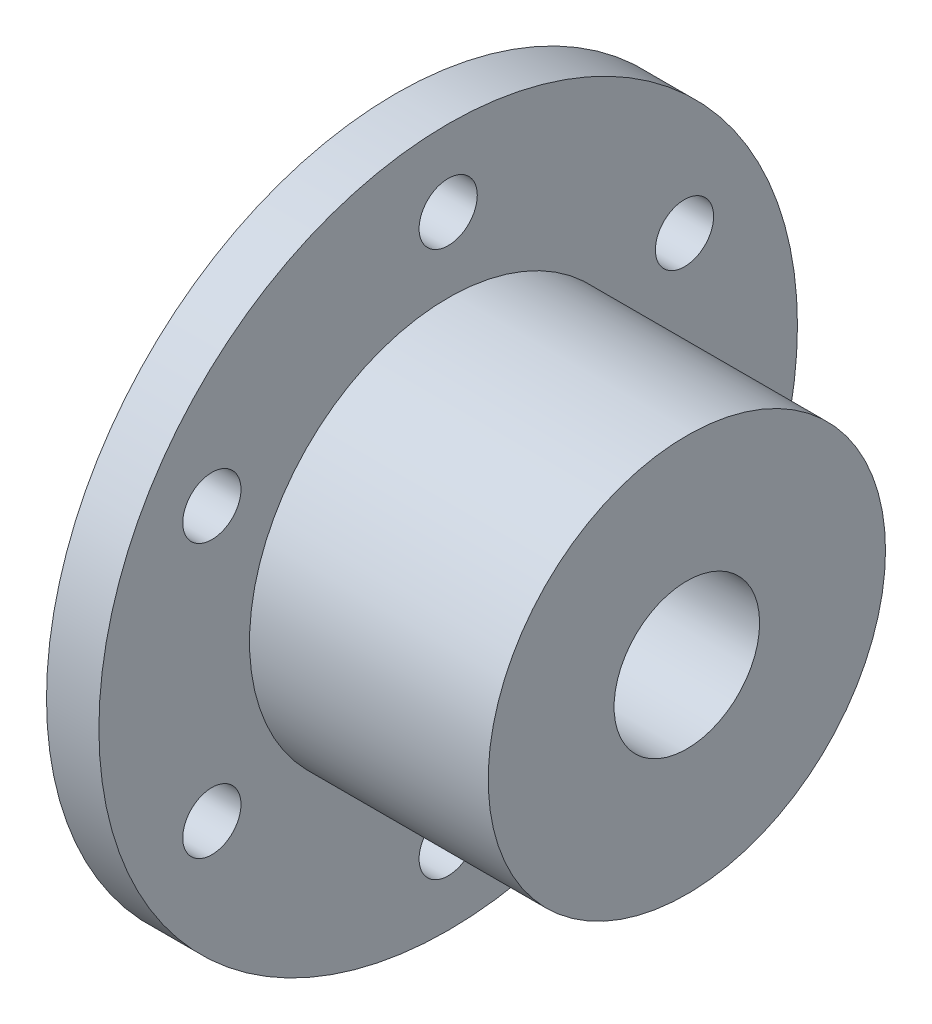
ISO-10303-21;
HEADER;
FILE_DESCRIPTION(('STEP AP214'),'2;1');
FILE_NAME('part.step','',(''),(''),'','','');
FILE_SCHEMA(('AUTOMOTIVE_DESIGN { 1 0 10303 214 1 1 1 1 }'));
ENDSEC;
DATA;
#1=APPLICATION_CONTEXT('core data for automotive mechanical design processes');
#2=APPLICATION_PROTOCOL_DEFINITION('international standard','automotive_design',2000,#1);
#3=PRODUCT_CONTEXT('',#1,'mechanical');
#4=PRODUCT('Part','Part','',(#3));
#5=PRODUCT_RELATED_PRODUCT_CATEGORY('part','',(#4));
#6=PRODUCT_DEFINITION_FORMATION('','',#4);
#7=PRODUCT_DEFINITION_CONTEXT('part definition',#1,'design');
#8=PRODUCT_DEFINITION('design','',#6,#7);
#9=PRODUCT_DEFINITION_SHAPE('','',#8);
#10=(LENGTH_UNIT() NAMED_UNIT(*) SI_UNIT(.MILLI.,.METRE.));
#11=(NAMED_UNIT(*) PLANE_ANGLE_UNIT() SI_UNIT($,.RADIAN.));
#12=(NAMED_UNIT(*) SI_UNIT($,.STERADIAN.) SOLID_ANGLE_UNIT());
#13=UNCERTAINTY_MEASURE_WITH_UNIT(LENGTH_MEASURE(1.E-05),#10,'distance_accuracy_value','');
#14=(GEOMETRIC_REPRESENTATION_CONTEXT(3) GLOBAL_UNCERTAINTY_ASSIGNED_CONTEXT((#13)) GLOBAL_UNIT_ASSIGNED_CONTEXT((#10,
#11,#12)) REPRESENTATION_CONTEXT('',''));
#15=CARTESIAN_POINT('',(0.,0.,0.));
#16=DIRECTION('',(0.,0.,1.));
#17=DIRECTION('',(1.,0.,0.));
#18=AXIS2_PLACEMENT_3D('',#15,#16,#17);
#19=CARTESIAN_POINT('',(12.7,0.,0.));
#20=DIRECTION('',(1.,0.,0.));
#21=DIRECTION('',(0.,0.,-1.));
#22=AXIS2_PLACEMENT_3D('',#19,#20,#21);
#23=PLANE('',#22);
#24=CARTESIAN_POINT('',(12.7,0.,0.));
#25=DIRECTION('',(1.,0.,0.));
#26=DIRECTION('',(0.,0.,-1.));
#27=AXIS2_PLACEMENT_3D('',#24,#25,#26);
#28=CIRCLE('',#27,6.35);
#29=CARTESIAN_POINT('',(12.7,0.,-6.35));
#30=VERTEX_POINT('',#29);
#31=EDGE_CURVE('E43',#30,#30,#28,.T.);
#32=ORIENTED_EDGE('',*,*,#31,.F.);
#33=EDGE_LOOP('',(#32));
#34=FACE_BOUND('',#33,.T.);
#35=CARTESIAN_POINT('',(12.7,0.,0.));
#36=DIRECTION('',(1.,0.,0.));
#37=DIRECTION('',(0.,0.,-1.));
#38=AXIS2_PLACEMENT_3D('',#35,#36,#37);
#39=CIRCLE('',#38,17.3355);
#40=CARTESIAN_POINT('',(12.7,0.,-17.3355));
#41=VERTEX_POINT('',#40);
#42=EDGE_CURVE('E88',#41,#41,#39,.T.);
#43=ORIENTED_EDGE('',*,*,#42,.T.);
#44=EDGE_LOOP('',(#43));
#45=FACE_BOUND('',#44,.T.);
#46=ADVANCED_FACE('F35',(#34,#45),#23,.T.);
#47=CARTESIAN_POINT('',(12.7,0.,0.));
#48=DIRECTION('',(-1.,0.,0.));
#49=DIRECTION('',(0.,0.,1.));
#50=AXIS2_PLACEMENT_3D('',#47,#48,#49);
#51=CYLINDRICAL_SURFACE('',#50,30.48);
#52=CARTESIAN_POINT('',(-12.7,0.,0.));
#53=DIRECTION('',(1.,0.,0.));
#54=DIRECTION('',(0.,0.,-1.));
#55=AXIS2_PLACEMENT_3D('',#52,#53,#54);
#56=CIRCLE('',#55,30.48);
#57=CARTESIAN_POINT('',(-12.7,0.,-30.48));
#58=VERTEX_POINT('',#57);
#59=EDGE_CURVE('E11',#58,#58,#56,.T.);
#60=ORIENTED_EDGE('',*,*,#59,.T.);
#61=EDGE_LOOP('',(#60));
#62=FACE_BOUND('',#61,.T.);
#63=CARTESIAN_POINT('',(-8.128,0.,0.));
#64=DIRECTION('',(1.,0.,0.));
#65=DIRECTION('',(0.,0.,-1.));
#66=AXIS2_PLACEMENT_3D('',#63,#64,#65);
#67=CIRCLE('',#66,30.48);
#68=CARTESIAN_POINT('',(-8.128,0.,-30.48));
#69=VERTEX_POINT('',#68);
#70=EDGE_CURVE('E70',#69,#69,#67,.T.);
#71=ORIENTED_EDGE('',*,*,#70,.F.);
#72=EDGE_LOOP('',(#71));
#73=FACE_BOUND('',#72,.T.);
#74=ADVANCED_FACE('F37',(#62,#73),#51,.T.);
#75=CARTESIAN_POINT('',(12.7,23.8125,0.));
#76=DIRECTION('',(-1.,0.,0.));
#77=DIRECTION('',(0.,0.,1.));
#78=AXIS2_PLACEMENT_3D('',#75,#76,#77);
#79=CYLINDRICAL_SURFACE('',#78,2.54);
#80=CARTESIAN_POINT('',(-12.7,23.8125,0.));
#81=DIRECTION('',(1.,0.,0.));
#82=DIRECTION('',(0.,0.,-1.));
#83=AXIS2_PLACEMENT_3D('',#80,#81,#82);
#84=CIRCLE('',#83,2.54);
#85=CARTESIAN_POINT('',(-12.7,23.8125,-2.54));
#86=VERTEX_POINT('',#85);
#87=EDGE_CURVE('E51',#86,#86,#84,.T.);
#88=ORIENTED_EDGE('',*,*,#87,.F.);
#89=EDGE_LOOP('',(#88));
#90=FACE_BOUND('',#89,.T.);
#91=CARTESIAN_POINT('',(-8.128,23.8125,0.));
#92=DIRECTION('',(1.,0.,0.));
#93=DIRECTION('',(0.,0.,-1.));
#94=AXIS2_PLACEMENT_3D('',#91,#92,#93);
#95=CIRCLE('',#94,2.54);
#96=CARTESIAN_POINT('',(-8.128,23.8125,-2.54));
#97=VERTEX_POINT('',#96);
#98=EDGE_CURVE('E73',#97,#97,#95,.T.);
#99=ORIENTED_EDGE('',*,*,#98,.T.);
#100=EDGE_LOOP('',(#99));
#101=FACE_BOUND('',#100,.T.);
#102=ADVANCED_FACE('F120',(#90,#101),#79,.F.);
#103=CARTESIAN_POINT('',(12.7,11.9062500000009,-20.6222299276174));
#104=DIRECTION('',(-1.,0.,0.));
#105=DIRECTION('',(0.,0.,1.));
#106=AXIS2_PLACEMENT_3D('',#103,#104,#105);
#107=CYLINDRICAL_SURFACE('',#106,2.54000000000029);
#108=CARTESIAN_POINT('',(-12.7,11.9062500000009,-20.6222299276174));
#109=DIRECTION('',(1.,0.,0.));
#110=DIRECTION('',(0.,0.,-1.));
#111=AXIS2_PLACEMENT_3D('',#108,#109,#110);
#112=CIRCLE('',#111,2.54000000000029);
#113=CARTESIAN_POINT('',(-12.7,11.9062500000009,-23.1622299276177));
#114=VERTEX_POINT('',#113);
#115=EDGE_CURVE('E55',#114,#114,#112,.T.);
#116=ORIENTED_EDGE('',*,*,#115,.F.);
#117=EDGE_LOOP('',(#116));
#118=FACE_BOUND('',#117,.T.);
#119=CARTESIAN_POINT('',(-8.128,11.9062500000009,-20.6222299276174));
#120=DIRECTION('',(1.,0.,0.));
#121=DIRECTION('',(0.,0.,-1.));
#122=AXIS2_PLACEMENT_3D('',#119,#120,#121);
#123=CIRCLE('',#122,2.54000000000029);
#124=CARTESIAN_POINT('',(-8.128,11.9062500000009,-23.1622299276177));
#125=VERTEX_POINT('',#124);
#126=EDGE_CURVE('E76',#125,#125,#123,.T.);
#127=ORIENTED_EDGE('',*,*,#126,.T.);
#128=EDGE_LOOP('',(#127));
#129=FACE_BOUND('',#128,.T.);
#130=ADVANCED_FACE('F125',(#118,#129),#107,.F.);
#131=CARTESIAN_POINT('',(12.7,-11.9062499999991,-20.6222299276185));
#132=DIRECTION('',(-1.,0.,0.));
#133=DIRECTION('',(0.,0.,1.));
#134=AXIS2_PLACEMENT_3D('',#131,#132,#133);
#135=CYLINDRICAL_SURFACE('',#134,2.54000000000131);
#136=CARTESIAN_POINT('',(-12.7,-11.9062499999991,-20.6222299276185));
#137=DIRECTION('',(1.,0.,0.));
#138=DIRECTION('',(0.,0.,-1.));
#139=AXIS2_PLACEMENT_3D('',#136,#137,#138);
#140=CIRCLE('',#139,2.54000000000131);
#141=CARTESIAN_POINT('',(-12.7,-11.9062499999991,-23.1622299276198));
#142=VERTEX_POINT('',#141);
#143=EDGE_CURVE('E58',#142,#142,#140,.T.);
#144=ORIENTED_EDGE('',*,*,#143,.F.);
#145=EDGE_LOOP('',(#144));
#146=FACE_BOUND('',#145,.T.);
#147=CARTESIAN_POINT('',(-8.128,-11.9062499999991,-20.6222299276185));
#148=DIRECTION('',(1.,0.,0.));
#149=DIRECTION('',(0.,0.,-1.));
#150=AXIS2_PLACEMENT_3D('',#147,#148,#149);
#151=CIRCLE('',#150,2.54000000000131);
#152=CARTESIAN_POINT('',(-8.128,-11.9062499999991,-23.1622299276198));
#153=VERTEX_POINT('',#152);
#154=EDGE_CURVE('E79',#153,#153,#151,.T.);
#155=ORIENTED_EDGE('',*,*,#154,.T.);
#156=EDGE_LOOP('',(#155));
#157=FACE_BOUND('',#156,.T.);
#158=ADVANCED_FACE('F168',(#146,#157),#135,.F.);
#159=CARTESIAN_POINT('',(12.7,-23.8125,-2.02454348705355E-12));
#160=DIRECTION('',(-1.,0.,0.));
#161=DIRECTION('',(0.,0.,1.));
#162=AXIS2_PLACEMENT_3D('',#159,#160,#161);
#163=CYLINDRICAL_SURFACE('',#162,2.5400000000021);
#164=CARTESIAN_POINT('',(-12.7,-23.8125,-2.02454348705355E-12));
#165=DIRECTION('',(1.,0.,0.));
#166=DIRECTION('',(0.,0.,-1.));
#167=AXIS2_PLACEMENT_3D('',#164,#165,#166);
#168=CIRCLE('',#167,2.5400000000021);
#169=CARTESIAN_POINT('',(-12.7,-23.8125,-2.54000000000412));
#170=VERTEX_POINT('',#169);
#171=EDGE_CURVE('E61',#170,#170,#168,.T.);
#172=ORIENTED_EDGE('',*,*,#171,.F.);
#173=EDGE_LOOP('',(#172));
#174=FACE_BOUND('',#173,.T.);
#175=CARTESIAN_POINT('',(-8.128,-23.8125,-2.02454348705355E-12));
#176=DIRECTION('',(1.,0.,0.));
#177=DIRECTION('',(0.,0.,-1.));
#178=AXIS2_PLACEMENT_3D('',#175,#176,#177);
#179=CIRCLE('',#178,2.5400000000021);
#180=CARTESIAN_POINT('',(-8.128,-23.8125,-2.54000000000412));
#181=VERTEX_POINT('',#180);
#182=EDGE_CURVE('E82',#181,#181,#179,.T.);
#183=ORIENTED_EDGE('',*,*,#182,.T.);
#184=EDGE_LOOP('',(#183));
#185=FACE_BOUND('',#184,.T.);
#186=ADVANCED_FACE('F163',(#174,#185),#163,.F.);
#187=CARTESIAN_POINT('',(12.7,-11.9062500000009,20.6222299276154));
#188=DIRECTION('',(-1.,0.,0.));
#189=DIRECTION('',(0.,0.,1.));
#190=AXIS2_PLACEMENT_3D('',#187,#188,#189);
#191=CYLINDRICAL_SURFACE('',#190,2.54000000000193);
#192=CARTESIAN_POINT('',(-12.7,-11.9062500000009,20.6222299276154));
#193=DIRECTION('',(1.,0.,0.));
#194=DIRECTION('',(0.,0.,-1.));
#195=AXIS2_PLACEMENT_3D('',#192,#193,#194);
#196=CIRCLE('',#195,2.54000000000193);
#197=CARTESIAN_POINT('',(-12.7,-11.9062500000009,18.0822299276135));
#198=VERTEX_POINT('',#197);
#199=EDGE_CURVE('E64',#198,#198,#196,.T.);
#200=ORIENTED_EDGE('',*,*,#199,.F.);
#201=EDGE_LOOP('',(#200));
#202=FACE_BOUND('',#201,.T.);
#203=CARTESIAN_POINT('',(-8.128,-11.9062500000009,20.6222299276154));
#204=DIRECTION('',(1.,0.,0.));
#205=DIRECTION('',(0.,0.,-1.));
#206=AXIS2_PLACEMENT_3D('',#203,#204,#205);
#207=CIRCLE('',#206,2.54000000000193);
#208=CARTESIAN_POINT('',(-8.128,-11.9062500000009,18.0822299276135));
#209=VERTEX_POINT('',#208);
#210=EDGE_CURVE('E85',#209,#209,#207,.T.);
#211=ORIENTED_EDGE('',*,*,#210,.T.);
#212=EDGE_LOOP('',(#211));
#213=FACE_BOUND('',#212,.T.);
#214=ADVANCED_FACE('F143',(#202,#213),#191,.F.);
#215=CARTESIAN_POINT('',(12.7,11.9062499999991,20.6222299276164));
#216=DIRECTION('',(-1.,0.,0.));
#217=DIRECTION('',(0.,0.,1.));
#218=AXIS2_PLACEMENT_3D('',#215,#216,#217);
#219=CYLINDRICAL_SURFACE('',#218,2.54000000000102);
#220=CARTESIAN_POINT('',(-12.7,11.9062499999991,20.6222299276164));
#221=DIRECTION('',(1.,0.,0.));
#222=DIRECTION('',(0.,0.,-1.));
#223=AXIS2_PLACEMENT_3D('',#220,#221,#222);
#224=CIRCLE('',#223,2.54000000000102);
#225=CARTESIAN_POINT('',(-12.7,11.9062499999991,18.0822299276154));
#226=VERTEX_POINT('',#225);
#227=EDGE_CURVE('E67',#226,#226,#224,.T.);
#228=ORIENTED_EDGE('',*,*,#227,.F.);
#229=EDGE_LOOP('',(#228));
#230=FACE_BOUND('',#229,.T.);
#231=CARTESIAN_POINT('',(-8.128,11.9062499999991,20.6222299276164));
#232=DIRECTION('',(1.,0.,0.));
#233=DIRECTION('',(0.,0.,-1.));
#234=AXIS2_PLACEMENT_3D('',#231,#232,#233);
#235=CIRCLE('',#234,2.54000000000102);
#236=CARTESIAN_POINT('',(-8.128,11.9062499999991,18.0822299276154));
#237=VERTEX_POINT('',#236);
#238=EDGE_CURVE('E39',#237,#237,#235,.T.);
#239=ORIENTED_EDGE('',*,*,#238,.T.);
#240=EDGE_LOOP('',(#239));
#241=FACE_BOUND('',#240,.T.);
#242=ADVANCED_FACE('F98',(#230,#241),#219,.F.);
#243=CARTESIAN_POINT('',(-12.7,0.,0.));
#244=DIRECTION('',(1.,0.,0.));
#245=DIRECTION('',(0.,0.,-1.));
#246=AXIS2_PLACEMENT_3D('',#243,#244,#245);
#247=PLANE('',#246);
#248=ORIENTED_EDGE('',*,*,#59,.F.);
#249=EDGE_LOOP('',(#248));
#250=FACE_BOUND('',#249,.T.);
#251=CARTESIAN_POINT('',(-12.7,0.,0.));
#252=DIRECTION('',(1.,0.,0.));
#253=DIRECTION('',(0.,0.,-1.));
#254=AXIS2_PLACEMENT_3D('',#251,#252,#253);
#255=CIRCLE('',#254,6.35);
#256=CARTESIAN_POINT('',(-12.7,0.,-6.35));
#257=VERTEX_POINT('',#256);
#258=EDGE_CURVE('E47',#257,#257,#255,.T.);
#259=ORIENTED_EDGE('',*,*,#258,.T.);
#260=EDGE_LOOP('',(#259));
#261=FACE_BOUND('',#260,.T.);
#262=ORIENTED_EDGE('',*,*,#87,.T.);
#263=EDGE_LOOP('',(#262));
#264=FACE_BOUND('',#263,.T.);
#265=ORIENTED_EDGE('',*,*,#115,.T.);
#266=EDGE_LOOP('',(#265));
#267=FACE_BOUND('',#266,.T.);
#268=ORIENTED_EDGE('',*,*,#143,.T.);
#269=EDGE_LOOP('',(#268));
#270=FACE_BOUND('',#269,.T.);
#271=ORIENTED_EDGE('',*,*,#171,.T.);
#272=EDGE_LOOP('',(#271));
#273=FACE_BOUND('',#272,.T.);
#274=ORIENTED_EDGE('',*,*,#199,.T.);
#275=EDGE_LOOP('',(#274));
#276=FACE_BOUND('',#275,.T.);
#277=ORIENTED_EDGE('',*,*,#227,.T.);
#278=EDGE_LOOP('',(#277));
#279=FACE_BOUND('',#278,.T.);
#280=ADVANCED_FACE('F135',(#250,#261,#264,#267,#270,#273,#276,#279),#247,.F.);
#281=CARTESIAN_POINT('',(12.7,0.,0.));
#282=DIRECTION('',(-1.,0.,0.));
#283=DIRECTION('',(0.,0.,1.));
#284=AXIS2_PLACEMENT_3D('',#281,#282,#283);
#285=CYLINDRICAL_SURFACE('',#284,6.35);
#286=ORIENTED_EDGE('',*,*,#31,.T.);
#287=EDGE_LOOP('',(#286));
#288=FACE_BOUND('',#287,.T.);
#289=ORIENTED_EDGE('',*,*,#258,.F.);
#290=EDGE_LOOP('',(#289));
#291=FACE_BOUND('',#290,.T.);
#292=ADVANCED_FACE('F104',(#288,#291),#285,.F.);
#293=CARTESIAN_POINT('',(-8.128,0.,0.));
#294=DIRECTION('',(1.,0.,0.));
#295=DIRECTION('',(0.,0.,-1.));
#296=AXIS2_PLACEMENT_3D('',#293,#294,#295);
#297=PLANE('',#296);
#298=CARTESIAN_POINT('',(-8.128,0.,0.));
#299=DIRECTION('',(1.,0.,0.));
#300=DIRECTION('',(0.,0.,-1.));
#301=AXIS2_PLACEMENT_3D('',#298,#299,#300);
#302=CIRCLE('',#301,17.3355);
#303=CARTESIAN_POINT('',(-8.128,0.,-17.3355));
#304=VERTEX_POINT('',#303);
#305=EDGE_CURVE('E91',#304,#304,#302,.T.);
#306=ORIENTED_EDGE('',*,*,#305,.F.);
#307=EDGE_LOOP('',(#306));
#308=FACE_BOUND('',#307,.T.);
#309=ORIENTED_EDGE('',*,*,#238,.F.);
#310=EDGE_LOOP('',(#309));
#311=FACE_BOUND('',#310,.T.);
#312=ORIENTED_EDGE('',*,*,#210,.F.);
#313=EDGE_LOOP('',(#312));
#314=FACE_BOUND('',#313,.T.);
#315=ORIENTED_EDGE('',*,*,#182,.F.);
#316=EDGE_LOOP('',(#315));
#317=FACE_BOUND('',#316,.T.);
#318=ORIENTED_EDGE('',*,*,#154,.F.);
#319=EDGE_LOOP('',(#318));
#320=FACE_BOUND('',#319,.T.);
#321=ORIENTED_EDGE('',*,*,#126,.F.);
#322=EDGE_LOOP('',(#321));
#323=FACE_BOUND('',#322,.T.);
#324=ORIENTED_EDGE('',*,*,#98,.F.);
#325=EDGE_LOOP('',(#324));
#326=FACE_BOUND('',#325,.T.);
#327=ORIENTED_EDGE('',*,*,#70,.T.);
#328=EDGE_LOOP('',(#327));
#329=FACE_BOUND('',#328,.T.);
#330=ADVANCED_FACE('F100',(#308,#311,#314,#317,#320,#323,#326,#329),#297,.T.);
#331=CARTESIAN_POINT('',(-8.128,0.,0.));
#332=DIRECTION('',(1.,0.,0.));
#333=DIRECTION('',(0.,0.,-1.));
#334=AXIS2_PLACEMENT_3D('',#331,#332,#333);
#335=CYLINDRICAL_SURFACE('',#334,17.3355);
#336=ORIENTED_EDGE('',*,*,#305,.T.);
#337=EDGE_LOOP('',(#336));
#338=FACE_BOUND('',#337,.T.);
#339=ORIENTED_EDGE('',*,*,#42,.F.);
#340=EDGE_LOOP('',(#339));
#341=FACE_BOUND('',#340,.T.);
#342=ADVANCED_FACE('F103',(#338,#341),#335,.T.);
#343=CLOSED_SHELL('',(#46,#74,#102,#130,#158,#186,#214,#242,#280,#292,#330,#342));
#344=MANIFOLD_SOLID_BREP('B2',#343);
#345=ADVANCED_BREP_SHAPE_REPRESENTATION('',(#18,#344),#14);
#346=SHAPE_DEFINITION_REPRESENTATION(#9,#345);
ENDSEC;
END-ISO-10303-21;
